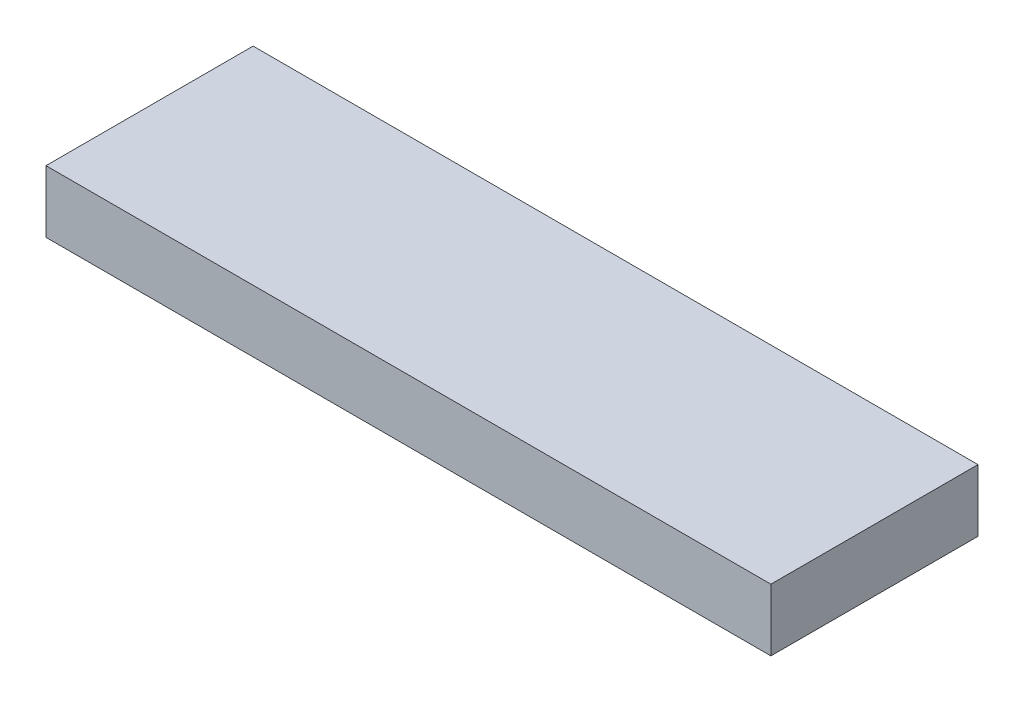
ISO-10303-21;
HEADER;
FILE_DESCRIPTION(('STEP AP214'),'2;1');
FILE_NAME('part.step','',(''),(''),'','','');
FILE_SCHEMA(('AUTOMOTIVE_DESIGN { 1 0 10303 214 1 1 1 1 }'));
ENDSEC;
DATA;
#1=APPLICATION_CONTEXT('core data for automotive mechanical design processes');
#2=APPLICATION_PROTOCOL_DEFINITION('international standard','automotive_design',2000,#1);
#3=PRODUCT_CONTEXT('',#1,'mechanical');
#4=PRODUCT('Part','Part','',(#3));
#5=PRODUCT_RELATED_PRODUCT_CATEGORY('part','',(#4));
#6=PRODUCT_DEFINITION_FORMATION('','',#4);
#7=PRODUCT_DEFINITION_CONTEXT('part definition',#1,'design');
#8=PRODUCT_DEFINITION('design','',#6,#7);
#9=PRODUCT_DEFINITION_SHAPE('','',#8);
#10=(LENGTH_UNIT() NAMED_UNIT(*) SI_UNIT(.MILLI.,.METRE.));
#11=(NAMED_UNIT(*) PLANE_ANGLE_UNIT() SI_UNIT($,.RADIAN.));
#12=(NAMED_UNIT(*) SI_UNIT($,.STERADIAN.) SOLID_ANGLE_UNIT());
#13=UNCERTAINTY_MEASURE_WITH_UNIT(LENGTH_MEASURE(1.E-05),#10,'distance_accuracy_value','');
#14=(GEOMETRIC_REPRESENTATION_CONTEXT(3) GLOBAL_UNCERTAINTY_ASSIGNED_CONTEXT((#13)) GLOBAL_UNIT_ASSIGNED_CONTEXT((#10,
#11,#12)) REPRESENTATION_CONTEXT('',''));
#15=CARTESIAN_POINT('',(0.,0.,0.));
#16=DIRECTION('',(0.,0.,1.));
#17=DIRECTION('',(1.,0.,0.));
#18=AXIS2_PLACEMENT_3D('',#15,#16,#17);
#19=CARTESIAN_POINT('',(0.,6.,0.));
#20=DIRECTION('',(1.,0.,0.));
#21=DIRECTION('',(0.,0.,-1.));
#22=AXIS2_PLACEMENT_3D('',#19,#20,#21);
#23=PLANE('',#22);
#24=DIRECTION('',(0.,0.,1.));
#25=VECTOR('',#24,1.);
#26=CARTESIAN_POINT('',(0.,0.,0.));
#27=LINE('',#26,#25);
#28=CARTESIAN_POINT('',(0.,0.,-20.));
#29=VERTEX_POINT('',#28);
#30=CARTESIAN_POINT('',(0.,0.,0.));
#31=VERTEX_POINT('',#30);
#32=EDGE_CURVE('E100',#29,#31,#27,.T.);
#33=ORIENTED_EDGE('',*,*,#32,.T.);
#34=DIRECTION('',(0.,-1.,0.));
#35=VECTOR('',#34,1.);
#36=CARTESIAN_POINT('',(0.,6.,0.));
#37=LINE('',#36,#35);
#38=CARTESIAN_POINT('',(0.,6.,0.));
#39=VERTEX_POINT('',#38);
#40=EDGE_CURVE('E11',#39,#31,#37,.T.);
#41=ORIENTED_EDGE('',*,*,#40,.F.);
#42=DIRECTION('',(0.,0.,1.));
#43=VECTOR('',#42,1.);
#44=CARTESIAN_POINT('',(0.,6.,0.));
#45=LINE('',#44,#43);
#46=CARTESIAN_POINT('',(0.,6.,-20.));
#47=VERTEX_POINT('',#46);
#48=EDGE_CURVE('E88',#47,#39,#45,.T.);
#49=ORIENTED_EDGE('',*,*,#48,.F.);
#50=DIRECTION('',(0.,-1.,0.));
#51=VECTOR('',#50,1.);
#52=CARTESIAN_POINT('',(0.,6.,-20.));
#53=LINE('',#52,#51);
#54=EDGE_CURVE('E96',#47,#29,#53,.T.);
#55=ORIENTED_EDGE('',*,*,#54,.T.);
#56=EDGE_LOOP('',(#33,#41,#49,#55));
#57=FACE_BOUND('',#56,.T.);
#58=ADVANCED_FACE('F37',(#57),#23,.F.);
#59=CARTESIAN_POINT('',(0.,6.,0.));
#60=DIRECTION('',(0.,0.,-1.));
#61=DIRECTION('',(-1.,0.,0.));
#62=AXIS2_PLACEMENT_3D('',#59,#60,#61);
#63=PLANE('',#62);
#64=DIRECTION('',(1.,0.,0.));
#65=VECTOR('',#64,1.);
#66=CARTESIAN_POINT('',(0.,0.,0.));
#67=LINE('',#66,#65);
#68=CARTESIAN_POINT('',(70.,0.,0.));
#69=VERTEX_POINT('',#68);
#70=EDGE_CURVE('E92',#31,#69,#67,.T.);
#71=ORIENTED_EDGE('',*,*,#70,.T.);
#72=DIRECTION('',(0.,-1.,0.));
#73=VECTOR('',#72,1.);
#74=CARTESIAN_POINT('',(70.,6.,0.));
#75=LINE('',#74,#73);
#76=CARTESIAN_POINT('',(70.,6.,0.));
#77=VERTEX_POINT('',#76);
#78=EDGE_CURVE('E45',#77,#69,#75,.T.);
#79=ORIENTED_EDGE('',*,*,#78,.F.);
#80=DIRECTION('',(1.,0.,0.));
#81=VECTOR('',#80,1.);
#82=CARTESIAN_POINT('',(0.,6.,0.));
#83=LINE('',#82,#81);
#84=EDGE_CURVE('E83',#39,#77,#83,.T.);
#85=ORIENTED_EDGE('',*,*,#84,.F.);
#86=ORIENTED_EDGE('',*,*,#40,.T.);
#87=EDGE_LOOP('',(#71,#79,#85,#86));
#88=FACE_BOUND('',#87,.T.);
#89=ADVANCED_FACE('F91',(#88),#63,.F.);
#90=CARTESIAN_POINT('',(70.,6.,-20.));
#91=DIRECTION('',(-1.,0.,0.));
#92=DIRECTION('',(0.,0.,1.));
#93=AXIS2_PLACEMENT_3D('',#90,#91,#92);
#94=PLANE('',#93);
#95=DIRECTION('',(0.,0.,-1.));
#96=VECTOR('',#95,1.);
#97=CARTESIAN_POINT('',(70.,0.,-20.));
#98=LINE('',#97,#96);
#99=CARTESIAN_POINT('',(70.,0.,-20.));
#100=VERTEX_POINT('',#99);
#101=EDGE_CURVE('E70',#69,#100,#98,.T.);
#102=ORIENTED_EDGE('',*,*,#101,.T.);
#103=DIRECTION('',(0.,-1.,0.));
#104=VECTOR('',#103,1.);
#105=CARTESIAN_POINT('',(70.,6.,-20.));
#106=LINE('',#105,#104);
#107=CARTESIAN_POINT('',(70.,6.,-20.));
#108=VERTEX_POINT('',#107);
#109=EDGE_CURVE('E93',#108,#100,#106,.T.);
#110=ORIENTED_EDGE('',*,*,#109,.F.);
#111=DIRECTION('',(0.,0.,-1.));
#112=VECTOR('',#111,1.);
#113=CARTESIAN_POINT('',(70.,6.,-20.));
#114=LINE('',#113,#112);
#115=EDGE_CURVE('E86',#77,#108,#114,.T.);
#116=ORIENTED_EDGE('',*,*,#115,.F.);
#117=ORIENTED_EDGE('',*,*,#78,.T.);
#118=EDGE_LOOP('',(#102,#110,#116,#117));
#119=FACE_BOUND('',#118,.T.);
#120=ADVANCED_FACE('F94',(#119),#94,.F.);
#121=CARTESIAN_POINT('',(0.,6.,-20.));
#122=DIRECTION('',(0.,0.,1.));
#123=DIRECTION('',(1.,0.,0.));
#124=AXIS2_PLACEMENT_3D('',#121,#122,#123);
#125=PLANE('',#124);
#126=DIRECTION('',(-1.,0.,0.));
#127=VECTOR('',#126,1.);
#128=CARTESIAN_POINT('',(0.,0.,-20.));
#129=LINE('',#128,#127);
#130=EDGE_CURVE('E76',#100,#29,#129,.T.);
#131=ORIENTED_EDGE('',*,*,#130,.T.);
#132=ORIENTED_EDGE('',*,*,#54,.F.);
#133=DIRECTION('',(-1.,0.,0.));
#134=VECTOR('',#133,1.);
#135=CARTESIAN_POINT('',(0.,6.,-20.));
#136=LINE('',#135,#134);
#137=EDGE_CURVE('E53',#108,#47,#136,.T.);
#138=ORIENTED_EDGE('',*,*,#137,.F.);
#139=ORIENTED_EDGE('',*,*,#109,.T.);
#140=EDGE_LOOP('',(#131,#132,#138,#139));
#141=FACE_BOUND('',#140,.T.);
#142=ADVANCED_FACE('F107',(#141),#125,.F.);
#143=CARTESIAN_POINT('',(0.,6.,0.));
#144=DIRECTION('',(0.,-1.,0.));
#145=DIRECTION('',(0.,0.,-1.));
#146=AXIS2_PLACEMENT_3D('',#143,#144,#145);
#147=PLANE('',#146);
#148=ORIENTED_EDGE('',*,*,#48,.T.);
#149=ORIENTED_EDGE('',*,*,#84,.T.);
#150=ORIENTED_EDGE('',*,*,#115,.T.);
#151=ORIENTED_EDGE('',*,*,#137,.T.);
#152=EDGE_LOOP('',(#148,#149,#150,#151));
#153=FACE_BOUND('',#152,.T.);
#154=ADVANCED_FACE('F84',(#153),#147,.F.);
#155=CARTESIAN_POINT('',(0.,0.,0.));
#156=DIRECTION('',(0.,-1.,0.));
#157=DIRECTION('',(0.,0.,-1.));
#158=AXIS2_PLACEMENT_3D('',#155,#156,#157);
#159=PLANE('',#158);
#160=ORIENTED_EDGE('',*,*,#32,.F.);
#161=ORIENTED_EDGE('',*,*,#130,.F.);
#162=ORIENTED_EDGE('',*,*,#101,.F.);
#163=ORIENTED_EDGE('',*,*,#70,.F.);
#164=EDGE_LOOP('',(#160,#161,#162,#163));
#165=FACE_BOUND('',#164,.T.);
#166=ADVANCED_FACE('F110',(#165),#159,.T.);
#167=CLOSED_SHELL('',(#58,#89,#120,#142,#154,#166));
#168=MANIFOLD_SOLID_BREP('B2',#167);
#169=ADVANCED_BREP_SHAPE_REPRESENTATION('',(#18,#168),#14);
#170=SHAPE_DEFINITION_REPRESENTATION(#9,#169);
ENDSEC;
END-ISO-10303-21;
